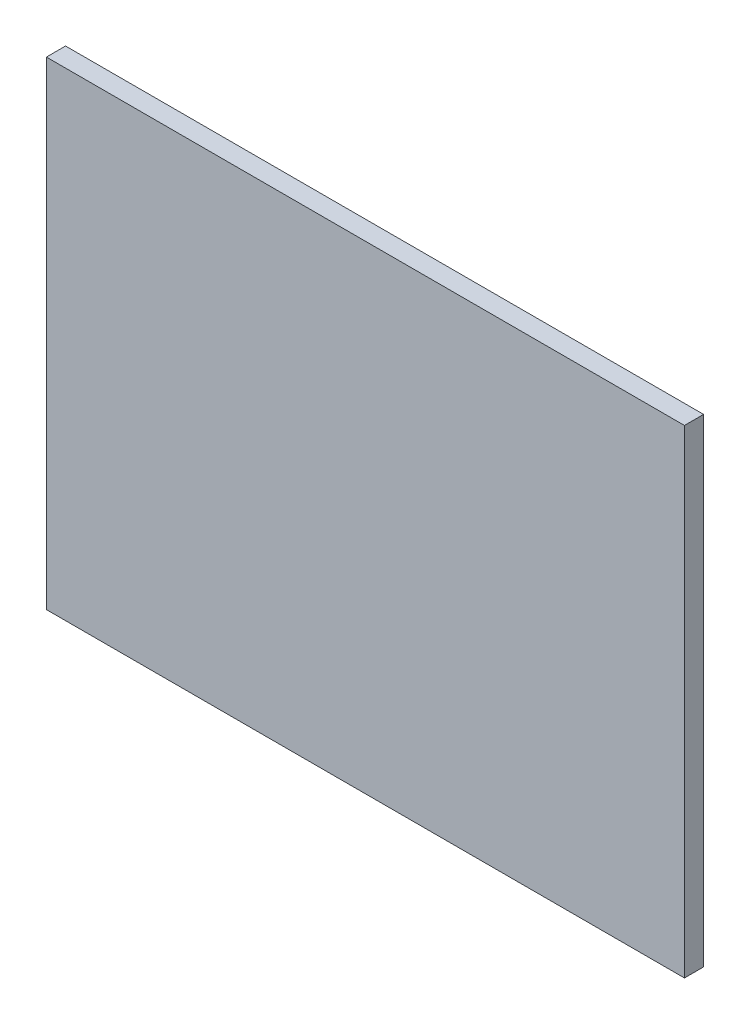
ISO-10303-21;
HEADER;
FILE_DESCRIPTION(('STEP AP214'),'2;1');
FILE_NAME('part.step','',(''),(''),'','','');
FILE_SCHEMA(('AUTOMOTIVE_DESIGN { 1 0 10303 214 1 1 1 1 }'));
ENDSEC;
DATA;
#1=APPLICATION_CONTEXT('core data for automotive mechanical design processes');
#2=APPLICATION_PROTOCOL_DEFINITION('international standard','automotive_design',2000,#1);
#3=PRODUCT_CONTEXT('',#1,'mechanical');
#4=PRODUCT('Part','Part','',(#3));
#5=PRODUCT_RELATED_PRODUCT_CATEGORY('part','',(#4));
#6=PRODUCT_DEFINITION_FORMATION('','',#4);
#7=PRODUCT_DEFINITION_CONTEXT('part definition',#1,'design');
#8=PRODUCT_DEFINITION('design','',#6,#7);
#9=PRODUCT_DEFINITION_SHAPE('','',#8);
#10=(LENGTH_UNIT() NAMED_UNIT(*) SI_UNIT(.MILLI.,.METRE.));
#11=(NAMED_UNIT(*) PLANE_ANGLE_UNIT() SI_UNIT($,.RADIAN.));
#12=(NAMED_UNIT(*) SI_UNIT($,.STERADIAN.) SOLID_ANGLE_UNIT());
#13=UNCERTAINTY_MEASURE_WITH_UNIT(LENGTH_MEASURE(1.E-05),#10,'distance_accuracy_value','');
#14=(GEOMETRIC_REPRESENTATION_CONTEXT(3) GLOBAL_UNCERTAINTY_ASSIGNED_CONTEXT((#13)) GLOBAL_UNIT_ASSIGNED_CONTEXT((#10,
#11,#12)) REPRESENTATION_CONTEXT('',''));
#15=CARTESIAN_POINT('',(0.,0.,0.));
#16=DIRECTION('',(0.,0.,1.));
#17=DIRECTION('',(1.,0.,0.));
#18=AXIS2_PLACEMENT_3D('',#15,#16,#17);
#19=CARTESIAN_POINT('',(50.,37.5,3.));
#20=DIRECTION('',(-1.,0.,0.));
#21=DIRECTION('',(0.,-1.,0.));
#22=AXIS2_PLACEMENT_3D('',#19,#20,#21);
#23=PLANE('',#22);
#24=DIRECTION('',(0.,1.,0.));
#25=VECTOR('',#24,1.);
#26=CARTESIAN_POINT('',(50.,37.5,0.));
#27=LINE('',#26,#25);
#28=CARTESIAN_POINT('',(50.,-37.5,0.));
#29=VERTEX_POINT('',#28);
#30=CARTESIAN_POINT('',(50.,37.5,0.));
#31=VERTEX_POINT('',#30);
#32=EDGE_CURVE('E104',#29,#31,#27,.T.);
#33=ORIENTED_EDGE('',*,*,#32,.T.);
#34=DIRECTION('',(0.,0.,-1.));
#35=VECTOR('',#34,1.);
#36=CARTESIAN_POINT('',(50.,37.5,3.));
#37=LINE('',#36,#35);
#38=CARTESIAN_POINT('',(50.,37.5,3.));
#39=VERTEX_POINT('',#38);
#40=EDGE_CURVE('E11',#39,#31,#37,.T.);
#41=ORIENTED_EDGE('',*,*,#40,.F.);
#42=DIRECTION('',(0.,1.,0.));
#43=VECTOR('',#42,1.);
#44=CARTESIAN_POINT('',(50.,37.5,3.));
#45=LINE('',#44,#43);
#46=CARTESIAN_POINT('',(50.,-37.5,3.));
#47=VERTEX_POINT('',#46);
#48=EDGE_CURVE('E92',#47,#39,#45,.T.);
#49=ORIENTED_EDGE('',*,*,#48,.F.);
#50=DIRECTION('',(0.,0.,-1.));
#51=VECTOR('',#50,1.);
#52=CARTESIAN_POINT('',(50.,-37.5,3.));
#53=LINE('',#52,#51);
#54=EDGE_CURVE('E100',#47,#29,#53,.T.);
#55=ORIENTED_EDGE('',*,*,#54,.T.);
#56=EDGE_LOOP('',(#33,#41,#49,#55));
#57=FACE_BOUND('',#56,.T.);
#58=ADVANCED_FACE('F41',(#57),#23,.F.);
#59=CARTESIAN_POINT('',(-50.,37.5,3.));
#60=DIRECTION('',(0.,-1.,0.));
#61=DIRECTION('',(0.,0.,-1.));
#62=AXIS2_PLACEMENT_3D('',#59,#60,#61);
#63=PLANE('',#62);
#64=DIRECTION('',(-1.,0.,0.));
#65=VECTOR('',#64,1.);
#66=CARTESIAN_POINT('',(-50.,37.5,0.));
#67=LINE('',#66,#65);
#68=CARTESIAN_POINT('',(-50.,37.5,0.));
#69=VERTEX_POINT('',#68);
#70=EDGE_CURVE('E96',#31,#69,#67,.T.);
#71=ORIENTED_EDGE('',*,*,#70,.T.);
#72=DIRECTION('',(0.,0.,-1.));
#73=VECTOR('',#72,1.);
#74=CARTESIAN_POINT('',(-50.,37.5,3.));
#75=LINE('',#74,#73);
#76=CARTESIAN_POINT('',(-50.,37.5,3.));
#77=VERTEX_POINT('',#76);
#78=EDGE_CURVE('E49',#77,#69,#75,.T.);
#79=ORIENTED_EDGE('',*,*,#78,.F.);
#80=DIRECTION('',(-1.,0.,0.));
#81=VECTOR('',#80,1.);
#82=CARTESIAN_POINT('',(-50.,37.5,3.));
#83=LINE('',#82,#81);
#84=EDGE_CURVE('E87',#39,#77,#83,.T.);
#85=ORIENTED_EDGE('',*,*,#84,.F.);
#86=ORIENTED_EDGE('',*,*,#40,.T.);
#87=EDGE_LOOP('',(#71,#79,#85,#86));
#88=FACE_BOUND('',#87,.T.);
#89=ADVANCED_FACE('F95',(#88),#63,.F.);
#90=CARTESIAN_POINT('',(-50.,37.5,3.));
#91=DIRECTION('',(1.,0.,0.));
#92=DIRECTION('',(0.,1.,0.));
#93=AXIS2_PLACEMENT_3D('',#90,#91,#92);
#94=PLANE('',#93);
#95=DIRECTION('',(0.,-1.,0.));
#96=VECTOR('',#95,1.);
#97=CARTESIAN_POINT('',(-50.,37.5,0.));
#98=LINE('',#97,#96);
#99=CARTESIAN_POINT('',(-50.,-37.5,0.));
#100=VERTEX_POINT('',#99);
#101=EDGE_CURVE('E74',#69,#100,#98,.T.);
#102=ORIENTED_EDGE('',*,*,#101,.T.);
#103=DIRECTION('',(0.,0.,-1.));
#104=VECTOR('',#103,1.);
#105=CARTESIAN_POINT('',(-50.,-37.5,3.));
#106=LINE('',#105,#104);
#107=CARTESIAN_POINT('',(-50.,-37.5,3.));
#108=VERTEX_POINT('',#107);
#109=EDGE_CURVE('E97',#108,#100,#106,.T.);
#110=ORIENTED_EDGE('',*,*,#109,.F.);
#111=DIRECTION('',(0.,-1.,0.));
#112=VECTOR('',#111,1.);
#113=CARTESIAN_POINT('',(-50.,37.5,3.));
#114=LINE('',#113,#112);
#115=EDGE_CURVE('E90',#77,#108,#114,.T.);
#116=ORIENTED_EDGE('',*,*,#115,.F.);
#117=ORIENTED_EDGE('',*,*,#78,.T.);
#118=EDGE_LOOP('',(#102,#110,#116,#117));
#119=FACE_BOUND('',#118,.T.);
#120=ADVANCED_FACE('F98',(#119),#94,.F.);
#121=CARTESIAN_POINT('',(-50.,-37.5,3.));
#122=DIRECTION('',(0.,1.,0.));
#123=DIRECTION('',(0.,0.,1.));
#124=AXIS2_PLACEMENT_3D('',#121,#122,#123);
#125=PLANE('',#124);
#126=DIRECTION('',(1.,0.,0.));
#127=VECTOR('',#126,1.);
#128=CARTESIAN_POINT('',(-50.,-37.5,0.));
#129=LINE('',#128,#127);
#130=EDGE_CURVE('E80',#100,#29,#129,.T.);
#131=ORIENTED_EDGE('',*,*,#130,.T.);
#132=ORIENTED_EDGE('',*,*,#54,.F.);
#133=DIRECTION('',(1.,0.,0.));
#134=VECTOR('',#133,1.);
#135=CARTESIAN_POINT('',(-50.,-37.5,3.));
#136=LINE('',#135,#134);
#137=EDGE_CURVE('E57',#108,#47,#136,.T.);
#138=ORIENTED_EDGE('',*,*,#137,.F.);
#139=ORIENTED_EDGE('',*,*,#109,.T.);
#140=EDGE_LOOP('',(#131,#132,#138,#139));
#141=FACE_BOUND('',#140,.T.);
#142=ADVANCED_FACE('F111',(#141),#125,.F.);
#143=CARTESIAN_POINT('',(0.,0.,3.));
#144=DIRECTION('',(0.,0.,1.));
#145=DIRECTION('',(1.,0.,0.));
#146=AXIS2_PLACEMENT_3D('',#143,#144,#145);
#147=PLANE('',#146);
#148=ORIENTED_EDGE('',*,*,#48,.T.);
#149=ORIENTED_EDGE('',*,*,#84,.T.);
#150=ORIENTED_EDGE('',*,*,#115,.T.);
#151=ORIENTED_EDGE('',*,*,#137,.T.);
#152=EDGE_LOOP('',(#148,#149,#150,#151));
#153=FACE_BOUND('',#152,.T.);
#154=ADVANCED_FACE('F88',(#153),#147,.T.);
#155=CARTESIAN_POINT('',(0.,0.,0.));
#156=DIRECTION('',(0.,0.,1.));
#157=DIRECTION('',(1.,0.,0.));
#158=AXIS2_PLACEMENT_3D('',#155,#156,#157);
#159=PLANE('',#158);
#160=ORIENTED_EDGE('',*,*,#32,.F.);
#161=ORIENTED_EDGE('',*,*,#130,.F.);
#162=ORIENTED_EDGE('',*,*,#101,.F.);
#163=ORIENTED_EDGE('',*,*,#70,.F.);
#164=EDGE_LOOP('',(#160,#161,#162,#163));
#165=FACE_BOUND('',#164,.T.);
#166=ADVANCED_FACE('F114',(#165),#159,.F.);
#167=CLOSED_SHELL('',(#58,#89,#120,#142,#154,#166));
#168=MANIFOLD_SOLID_BREP('B2',#167);
#169=ADVANCED_BREP_SHAPE_REPRESENTATION('',(#18,#168),#14);
#170=SHAPE_DEFINITION_REPRESENTATION(#9,#169);
ENDSEC;
END-ISO-10303-21;
